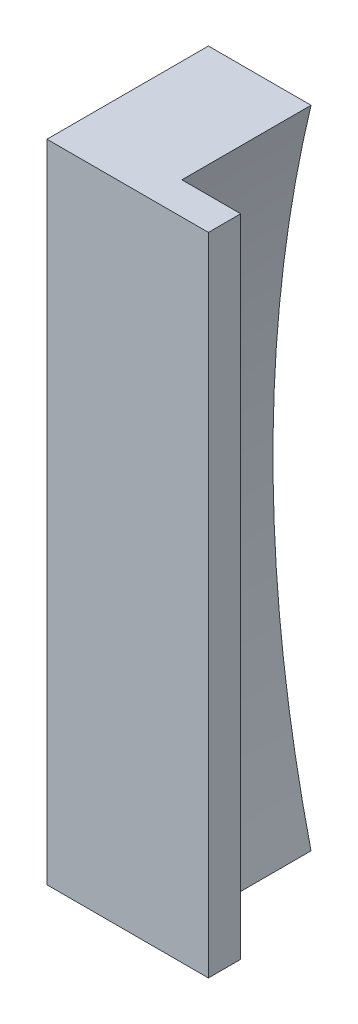
ISO-10303-21;
HEADER;
FILE_DESCRIPTION(('STEP AP214'),'2;1');
FILE_NAME('part.step','',(''),(''),'','','');
FILE_SCHEMA(('AUTOMOTIVE_DESIGN { 1 0 10303 214 1 1 1 1 }'));
ENDSEC;
DATA;
#1=APPLICATION_CONTEXT('core data for automotive mechanical design processes');
#2=APPLICATION_PROTOCOL_DEFINITION('international standard','automotive_design',2000,#1);
#3=PRODUCT_CONTEXT('',#1,'mechanical');
#4=PRODUCT('Part','Part','',(#3));
#5=PRODUCT_RELATED_PRODUCT_CATEGORY('part','',(#4));
#6=PRODUCT_DEFINITION_FORMATION('','',#4);
#7=PRODUCT_DEFINITION_CONTEXT('part definition',#1,'design');
#8=PRODUCT_DEFINITION('design','',#6,#7);
#9=PRODUCT_DEFINITION_SHAPE('','',#8);
#10=(LENGTH_UNIT() NAMED_UNIT(*) SI_UNIT(.MILLI.,.METRE.));
#11=(NAMED_UNIT(*) PLANE_ANGLE_UNIT() SI_UNIT($,.RADIAN.));
#12=(NAMED_UNIT(*) SI_UNIT($,.STERADIAN.) SOLID_ANGLE_UNIT());
#13=UNCERTAINTY_MEASURE_WITH_UNIT(LENGTH_MEASURE(1.E-05),#10,'distance_accuracy_value','');
#14=(GEOMETRIC_REPRESENTATION_CONTEXT(3) GLOBAL_UNCERTAINTY_ASSIGNED_CONTEXT((#13)) GLOBAL_UNIT_ASSIGNED_CONTEXT((#10,
#11,#12)) REPRESENTATION_CONTEXT('',''));
#15=CARTESIAN_POINT('',(0.,0.,0.));
#16=DIRECTION('',(0.,0.,1.));
#17=DIRECTION('',(1.,0.,0.));
#18=AXIS2_PLACEMENT_3D('',#15,#16,#17);
#19=CARTESIAN_POINT('',(-225.,-50.,20.));
#20=DIRECTION('',(0.,1.,0.));
#21=DIRECTION('',(0.,0.,1.));
#22=AXIS2_PLACEMENT_3D('',#19,#20,#21);
#23=PLANE('',#22);
#24=DIRECTION('',(1.,0.,0.));
#25=VECTOR('',#24,1.);
#26=CARTESIAN_POINT('',(-225.,-50.,0.));
#27=LINE('',#26,#25);
#28=CARTESIAN_POINT('',(-225.,-50.,0.));
#29=VERTEX_POINT('',#28);
#30=CARTESIAN_POINT('',(-209.105236663265,-49.9999999999999,0.));
#31=VERTEX_POINT('',#30);
#32=EDGE_CURVE('E113',#29,#31,#27,.T.);
#33=ORIENTED_EDGE('',*,*,#32,.T.);
#34=DIRECTION('',(0.,0.,-1.));
#35=VECTOR('',#34,1.);
#36=CARTESIAN_POINT('',(-209.105236663265,-49.9999999999999,20.));
#37=LINE('',#36,#35);
#38=CARTESIAN_POINT('',(-209.105236663265,-49.9999999999999,20.));
#39=VERTEX_POINT('',#38);
#40=EDGE_CURVE('E13',#39,#31,#37,.T.);
#41=ORIENTED_EDGE('',*,*,#40,.F.);
#42=DIRECTION('',(1.,0.,0.));
#43=VECTOR('',#42,1.);
#44=CARTESIAN_POINT('',(-225.,-50.,20.));
#45=LINE('',#44,#43);
#46=CARTESIAN_POINT('',(-200.,-50.,20.));
#47=VERTEX_POINT('',#46);
#48=EDGE_CURVE('E126',#39,#47,#45,.T.);
#49=ORIENTED_EDGE('',*,*,#48,.T.);
#50=DIRECTION('',(0.,0.,-1.));
#51=VECTOR('',#50,1.);
#52=CARTESIAN_POINT('',(-200.,-50.,25.));
#53=LINE('',#52,#51);
#54=CARTESIAN_POINT('',(-200.,-50.,25.));
#55=VERTEX_POINT('',#54);
#56=EDGE_CURVE('E129',#55,#47,#53,.T.);
#57=ORIENTED_EDGE('',*,*,#56,.F.);
#58=DIRECTION('',(1.,0.,0.));
#59=VECTOR('',#58,1.);
#60=CARTESIAN_POINT('',(-225.,-50.,25.));
#61=LINE('',#60,#59);
#62=CARTESIAN_POINT('',(-225.,-50.,25.));
#63=VERTEX_POINT('',#62);
#64=EDGE_CURVE('E138',#63,#55,#61,.T.);
#65=ORIENTED_EDGE('',*,*,#64,.F.);
#66=DIRECTION('',(0.,0.,-1.));
#67=VECTOR('',#66,1.);
#68=CARTESIAN_POINT('',(-225.,-50.,20.));
#69=LINE('',#68,#67);
#70=EDGE_CURVE('E108',#63,#29,#69,.T.);
#71=ORIENTED_EDGE('',*,*,#70,.T.);
#72=EDGE_LOOP('',(#33,#41,#49,#57,#65,#71));
#73=FACE_BOUND('',#72,.T.);
#74=ADVANCED_FACE('F51',(#73),#23,.F.);
#75=CARTESIAN_POINT('',(0.,0.,20.));
#76=DIRECTION('',(0.,0.,-1.));
#77=DIRECTION('',(-1.,0.,0.));
#78=AXIS2_PLACEMENT_3D('',#75,#76,#77);
#79=CYLINDRICAL_SURFACE('',#78,215.);
#80=CARTESIAN_POINT('',(-214.067746286076,19.9999999999999,14.6));
#81=CARTESIAN_POINT('',(-214.056683686705,20.118405768322,14.5999948020439));
#82=CARTESIAN_POINT('',(-214.045514038665,20.2368883065541,14.5899528441461));
#83=CARTESIAN_POINT('',(-214.023291392187,20.4705780491656,14.5500340414459));
#84=CARTESIAN_POINT('',(-214.012238551856,20.5857811018568,14.5201331273663));
#85=CARTESIAN_POINT('',(-213.990600998757,20.8095004724153,14.4413299024022));
#86=CARTESIAN_POINT('',(-213.98001609501,20.9180195254646,14.3924354245984));
#87=CARTESIAN_POINT('',(-213.959653102438,21.1252858532946,14.2770200021731));
#88=CARTESIAN_POINT('',(-213.949874806753,21.2240356347757,14.2105035953632));
#89=CARTESIAN_POINT('',(-213.931463061234,21.4088238080695,14.0618122799865));
#90=CARTESIAN_POINT('',(-213.922827922834,21.4948809701974,13.9796609135762));
#91=CARTESIAN_POINT('',(-213.906985360523,21.651971359339,13.801943015109));
#92=CARTESIAN_POINT('',(-213.899777962424,21.7230043147404,13.7063762405762));
#93=CARTESIAN_POINT('',(-213.887078951397,21.8476859682228,13.50499690364));
#94=CARTESIAN_POINT('',(-213.881579807887,21.9014110056734,13.3992320832465));
#95=CARTESIAN_POINT('',(-213.872455363641,21.9903353083278,13.1801065845262));
#96=CARTESIAN_POINT('',(-213.86883000485,22.0255351474878,13.0667461416531));
#97=CARTESIAN_POINT('',(-213.863600959992,22.0762505403622,12.8362236694212));
#98=CARTESIAN_POINT('',(-213.86198778453,22.0918584910434,12.7190821773704));
#99=CARTESIAN_POINT('',(-213.860812089535,22.1032370277366,12.4838305830348));
#100=CARTESIAN_POINT('',(-213.861249528835,22.0990080119807,12.3657205002423));
#101=CARTESIAN_POINT('',(-213.864154935625,22.0708728542559,12.1321902218266));
#102=CARTESIAN_POINT('',(-213.866617904808,22.0470151490457,12.0167641232541));
#103=CARTESIAN_POINT('',(-213.873476383068,21.9803824417683,11.7915695452984));
#104=CARTESIAN_POINT('',(-213.877871897723,21.9376073851129,11.681801082242));
#105=CARTESIAN_POINT('',(-213.888440963931,21.8343194712308,11.4708852436778));
#106=CARTESIAN_POINT('',(-213.894616634524,21.77378547281,11.3697483299458));
#107=CARTESIAN_POINT('',(-213.908522636441,21.6367435486169,11.1790699562606));
#108=CARTESIAN_POINT('',(-213.916252998311,21.5602353089766,11.0895287241998));
#109=CARTESIAN_POINT('',(-213.933034563232,21.3930781029328,10.9241792393322));
#110=CARTESIAN_POINT('',(-213.942091125842,21.30237164975,10.8484296496067));
#111=CARTESIAN_POINT('',(-213.961194830232,21.1096298121008,10.7132206084264));
#112=CARTESIAN_POINT('',(-213.971241998785,21.0075941214097,10.6537615974502));
#113=CARTESIAN_POINT('',(-213.992051370588,20.7945532944115,10.5525245213919));
#114=CARTESIAN_POINT('',(-214.002816804211,20.6835070720609,10.5108335717543));
#115=CARTESIAN_POINT('',(-214.024681655759,20.4560184733491,10.4467065915391));
#116=CARTESIAN_POINT('',(-214.035781080388,20.3395759886363,10.4242709477653));
#117=CARTESIAN_POINT('',(-214.058017390926,20.1042085834011,10.3992406484872));
#118=CARTESIAN_POINT('',(-214.069154285596,19.9852770472843,10.3967081595646));
#119=CARTESIAN_POINT('',(-214.091112855004,19.7486586008473,10.4117277217959));
#120=CARTESIAN_POINT('',(-214.101934528194,19.6309716966404,10.4292798715526));
#121=CARTESIAN_POINT('',(-214.122971273874,19.4001703672652,10.4839959757845));
#122=CARTESIAN_POINT('',(-214.133186247713,19.2870566866676,10.5211631100601));
#123=CARTESIAN_POINT('',(-214.152745331421,19.068657508172,10.6140827980269));
#124=CARTESIAN_POINT('',(-214.162089450417,18.9633719282355,10.6698351569112));
#125=CARTESIAN_POINT('',(-214.179658003397,18.7639045199138,10.798206782567));
#126=CARTESIAN_POINT('',(-214.187885128321,18.6696960818563,10.8707843301195));
#127=CARTESIAN_POINT('',(-214.203057831342,18.4948029749027,11.0308395789405));
#128=CARTESIAN_POINT('',(-214.210003433269,18.4141180545337,11.1183170030813));
#129=CARTESIAN_POINT('',(-214.222438548923,18.2688842370292,11.3053432694616));
#130=CARTESIAN_POINT('',(-214.227933340887,18.2042768983191,11.4048463784883));
#131=CARTESIAN_POINT('',(-214.237386596862,18.0926873088909,11.6133549643953));
#132=CARTESIAN_POINT('',(-214.241345092197,18.0457046988304,11.7223602474842));
#133=CARTESIAN_POINT('',(-214.247636123042,17.9708606159543,11.9463816009479));
#134=CARTESIAN_POINT('',(-214.249974115222,17.9429349781395,12.0613760835937));
#135=CARTESIAN_POINT('',(-214.253000593477,17.9067604992134,12.2944404260043));
#136=CARTESIAN_POINT('',(-214.253689098561,17.8985114313526,12.4125102503135));
#137=CARTESIAN_POINT('',(-214.25340379171,17.9019263136255,12.6481273471842));
#138=CARTESIAN_POINT('',(-214.252433230174,17.9135513269983,12.7656751901855));
#139=CARTESIAN_POINT('',(-214.248854506303,17.9563024251416,12.9971432490832));
#140=CARTESIAN_POINT('',(-214.246246346215,17.9874284831739,13.1110634699534));
#141=CARTESIAN_POINT('',(-214.239442715834,18.0682821466425,13.3320516897898));
#142=CARTESIAN_POINT('',(-214.235247198377,18.1180103047959,13.4391194850419));
#143=CARTESIAN_POINT('',(-214.225352371979,18.2346321828752,13.6433749752795));
#144=CARTESIAN_POINT('',(-214.219653111532,18.3015253492462,13.7405629887371));
#145=CARTESIAN_POINT('',(-214.206856437941,18.4506979197819,13.9225078620384));
#146=CARTESIAN_POINT('',(-214.1997564385,18.533005770839,14.0072412130688));
#147=CARTESIAN_POINT('',(-214.18431660534,18.7105972015089,14.1617137291843));
#148=CARTESIAN_POINT('',(-214.175976445055,18.8058841982919,14.2314489330218));
#149=CARTESIAN_POINT('',(-214.158214922374,19.0070832296884,14.3542014655185));
#150=CARTESIAN_POINT('',(-214.148789516164,19.1130348050698,14.4071533151264));
#151=CARTESIAN_POINT('',(-214.129118401254,19.3321676263891,14.4944623211581));
#152=CARTESIAN_POINT('',(-214.118873668081,19.4453402431064,14.5288412237953));
#153=CARTESIAN_POINT('',(-214.101758599373,19.6326832775439,14.568947454385));
#154=CARTESIAN_POINT('',(-214.09505474806,19.7056581036002,14.5805785729698));
#155=CARTESIAN_POINT('',(-214.081496558762,19.8524120085444,14.5961064731189));
#156=CARTESIAN_POINT('',(-214.074642220495,19.9261910889406,14.6000032401756));
#157=CARTESIAN_POINT('',(-214.067746286076,19.9999999999999,14.6));
#158=B_SPLINE_CURVE_WITH_KNOTS('',3,(#80,#81,#82,#83,#84,#85,#86,#87,#88,#89,#90,#91,#92,#93,
#94,#95,#96,#97,#98,#99,#100,#101,#102,#103,#104,#105,#106,#107,#108,#109,#110,#111,#112,#113,
#114,#115,#116,#117,#118,#119,#120,#121,#122,#123,#124,#125,#126,#127,#128,#129,#130,#131,#132,
#133,#134,#135,#136,#137,#138,#139,#140,#141,#142,#143,#144,#145,#146,#147,#148,#149,#150,#151,
#152,#153,#154,#155,#156,#157),.UNSPECIFIED.,.T.,.F.,(4,2,2,2,2,2,2,2,2,2,2,2,2,2,2,2,2,2,2,2,2,
2,2,2,2,2,2,2,2,2,2,2,2,2,2,2,2,2,4),(0.,0.356494068993477,0.713421003201601,1.07020089421283,
1.42688900021646,1.7830442167116,2.13920587134096,2.49377439798953,2.84833193858696,
3.20121099619343,3.5540829696938,3.9060867807611,4.25809160758325,4.61051719207525,
4.96294970181406,5.31684794916714,5.67075576457844,6.02637933956689,6.3820100582159,
6.73875113319237,7.09549395954878,7.45229463553366,7.80909157171977,8.16501309309369,
8.52092799528955,8.87552961128027,9.23012399707067,9.58351849033485,9.9369089111175,
10.2896077721342,10.6423061495609,10.9950150074131,11.347712492178,11.7010673902625,
12.0545155006568,12.4093260573666,12.7637202772944,12.9859424717808,13.2081650830978),.UNSPECIFIED.);
#159=CARTESIAN_POINT('',(-214.067746286076,19.9999999999999,14.6));
#160=VERTEX_POINT('',#159);
#161=EDGE_CURVE('E54',#160,#160,#158,.T.);
#162=ORIENTED_EDGE('',*,*,#161,.T.);
#163=EDGE_LOOP('',(#162));
#164=FACE_BOUND('',#163,.T.);
#165=CARTESIAN_POINT('',(-214.067746286076,-20.0000000000001,14.6));
#166=CARTESIAN_POINT('',(-214.078795900817,-19.8817301882432,14.5999948287127));
#167=CARTESIAN_POINT('',(-214.089754686069,-19.7633660134423,14.5899760143676));
#168=CARTESIAN_POINT('',(-214.111181147996,-19.5298719662258,14.5501311704216));
#169=CARTESIAN_POINT('',(-214.121648223365,-19.4147461195444,14.5202815321056));
#170=CARTESIAN_POINT('',(-214.14180530518,-19.1911390769391,14.4415922570399));
#171=CARTESIAN_POINT('',(-214.151495590624,-19.0826554986662,14.39275947561));
#172=CARTESIAN_POINT('',(-214.169859527226,-18.8754365239951,14.277473733881));
#173=CARTESIAN_POINT('',(-214.178533437704,-18.7766986420797,14.2110252822542));
#174=CARTESIAN_POINT('',(-214.194647004915,-18.5919817928338,14.0625289656708));
#175=CARTESIAN_POINT('',(-214.202089270952,-18.5059758940168,13.9805148902506));
#176=CARTESIAN_POINT('',(-214.21559710789,-18.3489559037631,13.8031061334116));
#177=CARTESIAN_POINT('',(-214.221662650439,-18.2779421210901,13.7077111764799));
#178=CARTESIAN_POINT('',(-214.232268370517,-18.153212027931,13.5066373708163));
#179=CARTESIAN_POINT('',(-214.236814205529,-18.0994315938648,13.4009985966171));
#180=CARTESIAN_POINT('',(-214.244320142457,-18.0103663546156,13.1821400575692));
#181=CARTESIAN_POINT('',(-214.247280276693,-17.9750811724547,13.0689204472894));
#182=CARTESIAN_POINT('',(-214.251550468728,-17.9241117122173,12.8384830620942));
#183=CARTESIAN_POINT('',(-214.252865500128,-17.9083683549144,12.7212784440806));
#184=CARTESIAN_POINT('',(-214.253836836357,-17.8967437484406,12.4858822051492));
#185=CARTESIAN_POINT('',(-214.253493161433,-17.9008622568304,12.3676905962965));
#186=CARTESIAN_POINT('',(-214.251155280701,-17.9288218541853,12.133846354299));
#187=CARTESIAN_POINT('',(-214.249163344691,-17.9526358207727,12.0181904539625));
#188=CARTESIAN_POINT('',(-214.24357007756,-18.0192616041395,11.7925283998952));
#189=CARTESIAN_POINT('',(-214.239968745129,-18.0620734363788,11.6825222507622));
#190=CARTESIAN_POINT('',(-214.231224508482,-18.1654927502966,11.4711995659996));
#191=CARTESIAN_POINT('',(-214.226080612725,-18.2261116776438,11.369888673611));
#192=CARTESIAN_POINT('',(-214.214356677428,-18.3633908420134,11.1788857275132));
#193=CARTESIAN_POINT('',(-214.207776623607,-18.4400512385557,11.0891937893597));
#194=CARTESIAN_POINT('',(-214.193301960141,-18.6074300286016,10.9237285053768));
#195=CARTESIAN_POINT('',(-214.185404116339,-18.6981829694623,10.8479903921075));
#196=CARTESIAN_POINT('',(-214.168482323948,-18.8910172283054,10.7128172152537));
#197=CARTESIAN_POINT('',(-214.15945835444,-18.9930987567157,10.6533824545741));
#198=CARTESIAN_POINT('',(-214.140462898272,-19.2060825823008,10.5522727628087));
#199=CARTESIAN_POINT('',(-214.130488102057,-19.3170154527597,10.5106628557401));
#200=CARTESIAN_POINT('',(-214.109868884952,-19.5442332101485,10.4466591466568));
#201=CARTESIAN_POINT('',(-214.099224450201,-19.6605182078461,10.4242657425355));
#202=CARTESIAN_POINT('',(-214.077509950885,-19.8955700436321,10.3992593652539));
#203=CARTESIAN_POINT('',(-214.066438535328,-20.0143441041216,10.3967154259488));
#204=CARTESIAN_POINT('',(-214.044216174972,-20.2506198660373,10.4116507524333));
#205=CARTESIAN_POINT('',(-214.033065229036,-20.3681215492043,10.4291303051858));
#206=CARTESIAN_POINT('',(-214.010993983391,-20.5987354575835,10.4836716849768));
#207=CARTESIAN_POINT('',(-214.000074128857,-20.7118395098317,10.520768262069));
#208=CARTESIAN_POINT('',(-213.978826019155,-20.9302188939143,10.6135307408688));
#209=CARTESIAN_POINT('',(-213.968497763419,-21.0354942332924,10.6691966246827));
#210=CARTESIAN_POINT('',(-213.948780767776,-21.2350952401685,10.7974730114853));
#211=CARTESIAN_POINT('',(-213.939391015864,-21.3294327201228,10.8700649748949));
#212=CARTESIAN_POINT('',(-213.921857475038,-21.5045729274478,11.030191166402));
#213=CARTESIAN_POINT('',(-213.913713663388,-21.5853759017932,11.1177251217824));
#214=CARTESIAN_POINT('',(-213.898987952851,-21.7308143249997,11.3048958628025));
#215=CARTESIAN_POINT('',(-213.892400134157,-21.7955111026993,11.4044845236008));
#216=CARTESIAN_POINT('',(-213.880984312854,-21.9072526401793,11.6132085716819));
#217=CARTESIAN_POINT('',(-213.876156258132,-21.954297922697,11.7223436761351));
#218=CARTESIAN_POINT('',(-213.868457896042,-22.0291655838576,11.9464843481467));
#219=CARTESIAN_POINT('',(-213.865578044896,-22.0570816805916,12.0614582875088));
#220=CARTESIAN_POINT('',(-213.8618454339,-22.0932433942431,12.2944906483412));
#221=CARTESIAN_POINT('',(-213.86099263075,-22.1014894313355,12.4125490038704));
#222=CARTESIAN_POINT('',(-213.861345509201,-22.098074549562,12.6479698233375));
#223=CARTESIAN_POINT('',(-213.862544181949,-22.086481411117,12.7653332875067));
#224=CARTESIAN_POINT('',(-213.866941716245,-22.0438584163375,12.9964363034746));
#225=CARTESIAN_POINT('',(-213.870140572458,-22.0128286118411,13.1101758649375));
#226=CARTESIAN_POINT('',(-213.878420235235,-21.9322362640557,13.3308179327652));
#227=CARTESIAN_POINT('',(-213.883501118888,-21.8826729616314,13.4377201588614));
#228=CARTESIAN_POINT('',(-213.89535996321,-21.766450870668,13.641677652174));
#229=CARTESIAN_POINT('',(-213.902137882971,-21.6997924942274,13.7387331566794));
#230=CARTESIAN_POINT('',(-213.917175831463,-21.5510434846163,13.9206023983652));
#231=CARTESIAN_POINT('',(-213.925440705283,-21.4689023594679,14.0053744302969));
#232=CARTESIAN_POINT('',(-213.943154831161,-21.2916513514297,14.1599601822683));
#233=CARTESIAN_POINT('',(-213.952604405964,-21.1965379339021,14.2297698120355));
#234=CARTESIAN_POINT('',(-213.972424468131,-20.9955189408884,14.3528112577085));
#235=CARTESIAN_POINT('',(-213.982799646537,-20.8895579368049,14.405951651847));
#236=CARTESIAN_POINT('',(-214.004085700375,-20.6703502821146,14.4936235045811));
#237=CARTESIAN_POINT('',(-214.014995935786,-20.5571122880331,14.5281766316493));
#238=CARTESIAN_POINT('',(-214.032933298376,-20.3693104614001,14.5686063797261));
#239=CARTESIAN_POINT('',(-214.039902144317,-20.2959547608009,14.5803640329503));
#240=CARTESIAN_POINT('',(-214.053841347019,-20.1484117637729,14.5960624768592));
#241=CARTESIAN_POINT('',(-214.060811703783,-20.0742244649917,14.6000032454269));
#242=CARTESIAN_POINT('',(-214.067746286076,-20.0000000000001,14.6));
#243=B_SPLINE_CURVE_WITH_KNOTS('',3,(#165,#166,#167,#168,#169,#170,#171,#172,#173,#174,#175,
#176,#177,#178,#179,#180,#181,#182,#183,#184,#185,#186,#187,#188,#189,#190,#191,#192,#193,#194,
#195,#196,#197,#198,#199,#200,#201,#202,#203,#204,#205,#206,#207,#208,#209,#210,#211,#212,#213,
#214,#215,#216,#217,#218,#219,#220,#221,#222,#223,#224,#225,#226,#227,#228,#229,#230,#231,#232,
#233,#234,#235,#236,#237,#238,#239,#240,#241,#242),.UNSPECIFIED.,.T.,.F.,(4,2,2,2,2,2,2,2,2,2,2,
2,2,2,2,2,2,2,2,2,2,2,2,2,2,2,2,2,2,2,2,2,2,2,2,2,2,2,4),(0.,0.356083322055518,
0.712591324915856,1.06897070263874,1.42525895415758,1.78078245006333,2.13631326729009,
2.49050539998707,2.84469031311341,3.19780181874559,3.55090901421512,3.90353075809811,
4.25615278893308,4.60900196850351,4.96185465704918,5.31558641956617,5.66932475373181,
6.02434273733654,6.37936807170395,6.73562759001407,7.09189221405535,7.44879005809346,
7.80568755821699,8.16219596044061,8.51869785646784,8.87382076239439,9.22893315076492,
9.58229308199237,9.93564546497861,10.2877930304942,10.6399396568266,10.9921007087248,
11.3442532721262,11.6975747851843,12.0509927629131,12.4063164636392,12.761225036114,
12.9846972721718,13.2081701405177),.UNSPECIFIED.);
#244=CARTESIAN_POINT('',(-214.067746286076,-20.0000000000001,14.6));
#245=VERTEX_POINT('',#244);
#246=EDGE_CURVE('E197',#245,#245,#243,.T.);
#247=ORIENTED_EDGE('',*,*,#246,.T.);
#248=EDGE_LOOP('',(#247));
#249=FACE_BOUND('',#248,.T.);
#250=CARTESIAN_POINT('',(-212.132034355964,-35.,18.75));
#251=CARTESIAN_POINT('',(-212.157743198507,-34.8441793712154,18.7499933716047));
#252=CARTESIAN_POINT('',(-212.183297373692,-34.6882189341659,18.7367150361686));
#253=CARTESIAN_POINT('',(-212.233374020232,-34.380508019975,18.6838689365627));
#254=CARTESIAN_POINT('',(-212.257895237478,-34.2287627324341,18.6442701424659));
#255=CARTESIAN_POINT('',(-212.305225250416,-33.9339596426442,18.5397833808407));
#256=CARTESIAN_POINT('',(-212.328034274065,-33.7909006844136,18.4748987869237));
#257=CARTESIAN_POINT('',(-212.371337079663,-33.5176721108433,18.3215811309469));
#258=CARTESIAN_POINT('',(-212.391831493093,-33.3874989811483,18.2331545139174));
#259=CARTESIAN_POINT('',(-212.429856652566,-33.1446983474763,18.035843703183));
#260=CARTESIAN_POINT('',(-212.447406557849,-33.0319578229405,17.9271023385286));
#261=CARTESIAN_POINT('',(-212.479272223645,-32.8263572159575,17.6917988321495));
#262=CARTESIAN_POINT('',(-212.493588053931,-32.7334967046139,17.5652370749839));
#263=CARTESIAN_POINT('',(-212.518482086532,-32.5714819358498,17.2995103610135));
#264=CARTESIAN_POINT('',(-212.529102814437,-32.5020582488621,17.1605136499308));
#265=CARTESIAN_POINT('',(-212.54658703651,-32.3875241027983,16.8726197593757));
#266=CARTESIAN_POINT('',(-212.553450768691,-32.3424121035286,16.7237232077494));
#267=CARTESIAN_POINT('',(-212.563209410244,-32.2782133825113,16.4218474656339));
#268=CARTESIAN_POINT('',(-212.56614306324,-32.2588726123828,16.2689235160674));
#269=CARTESIAN_POINT('',(-212.568099852848,-32.2459760441981,15.9619697776144));
#270=CARTESIAN_POINT('',(-212.56712313046,-32.2524193164318,15.8079400288002));
#271=CARTESIAN_POINT('',(-212.561295355168,-32.2908049290213,15.5038748018486));
#272=CARTESIAN_POINT('',(-212.556461729418,-32.322632571544,15.3538244868133));
#273=CARTESIAN_POINT('',(-212.543053720328,-32.4106816061483,15.0612400415964));
#274=CARTESIAN_POINT('',(-212.534479329665,-32.4669030459852,14.9187059261299));
#275=CARTESIAN_POINT('',(-212.51376462174,-32.6022164635286,14.6448175781787));
#276=CARTESIAN_POINT('',(-212.501616126258,-32.6813608867798,14.5134898870922));
#277=CARTESIAN_POINT('',(-212.474045463912,-32.8601302163276,14.2659979771573));
#278=CARTESIAN_POINT('',(-212.458623183159,-32.9597558351266,14.1498342860658));
#279=CARTESIAN_POINT('',(-212.424728479017,-33.1775065868086,13.934905824599));
#280=CARTESIAN_POINT('',(-212.406231716431,-33.2957789176456,13.8362940590864));
#281=CARTESIAN_POINT('',(-212.366729942292,-33.5468051413594,13.6602933930752));
#282=CARTESIAN_POINT('',(-212.345724783422,-33.6795598847404,13.5829057399373));
#283=CARTESIAN_POINT('',(-212.301469044713,-33.957417989447,13.4505935245478));
#284=CARTESIAN_POINT('',(-212.278195210388,-34.1026469107973,13.3959404174788));
#285=CARTESIAN_POINT('',(-212.230212174801,-34.3999958067743,13.3118085331786));
#286=CARTESIAN_POINT('',(-212.205502883592,-34.5521162130902,13.2823313352929));
#287=CARTESIAN_POINT('',(-212.155036383962,-34.8606543341995,13.2491072247721));
#288=CARTESIAN_POINT('',(-212.129270826766,-35.0171005432724,13.2456372309196));
#289=CARTESIAN_POINT('',(-212.077662799502,-35.328314825461,13.2652200105769));
#290=CARTESIAN_POINT('',(-212.051820326316,-35.4830828293446,13.2882738741195));
#291=CARTESIAN_POINT('',(-212.000684465445,-35.7873400717416,13.3604621419051));
#292=CARTESIAN_POINT('',(-211.975394405173,-35.9367995893013,13.4097243159581));
#293=CARTESIAN_POINT('',(-211.926273346924,-36.2253516881851,13.5330924904769));
#294=CARTESIAN_POINT('',(-211.902442340208,-36.364444331593,13.6071983421477));
#295=CARTESIAN_POINT('',(-211.857098672941,-36.6276881238045,13.7779188040647));
#296=CARTESIAN_POINT('',(-211.835577268289,-36.7518958513474,13.8744437987641));
#297=CARTESIAN_POINT('',(-211.795473442638,-36.982308379589,14.0875221793148));
#298=CARTESIAN_POINT('',(-211.776890845874,-37.0885142569745,14.2040743665037));
#299=CARTESIAN_POINT('',(-211.743526141351,-37.2785241107381,14.4524275504157));
#300=CARTESIAN_POINT('',(-211.728701079833,-37.3625817570469,14.5840286499454));
#301=CARTESIAN_POINT('',(-211.703102692915,-37.5073558266605,14.8598594722536));
#302=CARTESIAN_POINT('',(-211.692329007697,-37.5680743228064,15.0040880721369));
#303=CARTESIAN_POINT('',(-211.675364168598,-37.6635438614028,15.2988036989541));
#304=CARTESIAN_POINT('',(-211.669108090953,-37.6986628734659,15.4491678346133));
#305=CARTESIAN_POINT('',(-211.66115782209,-37.7432748140074,15.7537661667482));
#306=CARTESIAN_POINT('',(-211.659463332097,-37.7527694208414,15.9080001090902));
#307=CARTESIAN_POINT('',(-211.660693871783,-37.745869672677,16.2143532010394));
#308=CARTESIAN_POINT('',(-211.663573901446,-37.7297275093696,16.3664782843939));
#309=CARTESIAN_POINT('',(-211.673761691015,-37.6725290451559,16.6658124300348));
#310=CARTESIAN_POINT('',(-211.681069407466,-37.6314729887701,16.8130215405546));
#311=CARTESIAN_POINT('',(-211.699847659805,-37.5256894328058,17.0984375254189));
#312=CARTESIAN_POINT('',(-211.71131955598,-37.4609541980502,17.2366414406741));
#313=CARTESIAN_POINT('',(-211.73801638221,-37.3097612829791,17.5001950175557));
#314=CARTESIAN_POINT('',(-211.753241326517,-37.2233035201802,17.62554463037));
#315=CARTESIAN_POINT('',(-211.787091015035,-37.0302275771936,17.8612125314347));
#316=CARTESIAN_POINT('',(-211.805748183234,-36.9234167453659,17.9713682633167));
#317=CARTESIAN_POINT('',(-211.845741891013,-36.6932590683021,18.1722601058035));
#318=CARTESIAN_POINT('',(-211.867079282819,-36.5699069626124,18.2629900146778));
#319=CARTESIAN_POINT('',(-211.912085022942,-36.3082098066352,18.423847869141));
#320=CARTESIAN_POINT('',(-211.93578357024,-36.1696673789892,18.4936458805326));
#321=CARTESIAN_POINT('',(-211.984482154049,-35.8831487243692,18.6088972228403));
#322=CARTESIAN_POINT('',(-212.009480726306,-35.7351830705676,18.6543773188855));
#323=CARTESIAN_POINT('',(-212.050859712508,-35.4886238322934,18.7080282791124));
#324=CARTESIAN_POINT('',(-212.067078715936,-35.3915796778759,18.7237476099516));
#325=CARTESIAN_POINT('',(-212.099563747362,-35.1963755369719,18.7447356043724));
#326=CARTESIAN_POINT('',(-212.115829775765,-35.0982155408833,18.7500041779541));
#327=CARTESIAN_POINT('',(-212.132034355964,-35.,18.75));
#328=B_SPLINE_CURVE_WITH_KNOTS('',3,(#250,#251,#252,#253,#254,#255,#256,#257,#258,#259,#260,
#261,#262,#263,#264,#265,#266,#267,#268,#269,#270,#271,#272,#273,#274,#275,#276,#277,#278,#279,
#280,#281,#282,#283,#284,#285,#286,#287,#288,#289,#290,#291,#292,#293,#294,#295,#296,#297,#298,
#299,#300,#301,#302,#303,#304,#305,#306,#307,#308,#309,#310,#311,#312,#313,#314,#315,#316,#317,
#318,#319,#320,#321,#322,#323,#324,#325,#326,#327),.UNSPECIFIED.,.T.,.F.,(4,2,2,2,2,2,2,2,2,2,2,
2,2,2,2,2,2,2,2,2,2,2,2,2,2,2,2,2,2,2,2,2,2,2,2,2,2,2,4),(0.,0.473421533439659,
0.947402189099539,1.42131962827115,1.89510745764135,2.36568165242444,2.83624569389949,
3.30119962157083,3.76612409002455,4.22643064408871,4.68672060076265,5.1449424665674,
5.60316522942994,6.0624447563142,6.52174026337457,6.98486197240363,7.44801089369379,
7.91654131614411,8.38510112848105,8.85864306525779,9.33220446356076,9.80809599643483,
10.2839846791238,10.7580028808826,11.2319927217009,11.7002913235348,12.1685483243249,
12.6299341705865,13.0912897961161,13.5481350546623,14.0049758295173,14.4619659720849,
14.9189578499326,15.3805120412854,15.8422133656887,16.3108499190925,16.7789696077691,
17.0773700950066,17.3757731520041),.UNSPECIFIED.);
#329=CARTESIAN_POINT('',(-212.132034355964,-35.,18.75));
#330=VERTEX_POINT('',#329);
#331=EDGE_CURVE('E187',#330,#330,#328,.T.);
#332=ORIENTED_EDGE('',*,*,#331,.T.);
#333=EDGE_LOOP('',(#332));
#334=FACE_BOUND('',#333,.T.);
#335=CARTESIAN_POINT('',(-212.132034355964,34.9999999999999,18.75));
#336=CARTESIAN_POINT('',(-212.106256083534,35.1562383845381,18.7499932939568));
#337=CARTESIAN_POINT('',(-212.080285050748,35.3125620230791,18.7366433738056));
#338=CARTESIAN_POINT('',(-212.028719648635,35.6208724988484,18.683568807864));
#339=CARTESIAN_POINT('',(-212.003125782368,35.7728537602495,18.6438117131309));
#340=CARTESIAN_POINT('',(-211.953112389655,36.0679989283668,18.538973386243));
#341=CARTESIAN_POINT('',(-211.928692567505,36.2111650578991,18.4738985687246));
#342=CARTESIAN_POINT('',(-211.881801791233,36.4845354434892,18.3201809891879));
#343=CARTESIAN_POINT('',(-211.859330300485,36.614743270108,18.2315447441895));
#344=CARTESIAN_POINT('',(-211.817187020335,36.857759552548,18.0336310838986));
#345=CARTESIAN_POINT('',(-211.797501126553,36.9706559245441,17.9244646908528));
#346=CARTESIAN_POINT('',(-211.761472324761,37.1764681525295,17.6882021758264));
#347=CARTESIAN_POINT('',(-211.745129321339,37.2693845787846,17.5611065657517));
#348=CARTESIAN_POINT('',(-211.716577318405,37.4312379773278,17.2944410386325));
#349=CARTESIAN_POINT('',(-211.704315016711,37.5004844805263,17.1550647226525));
#350=CARTESIAN_POINT('',(-211.684074255505,37.6145727950377,16.8663677072592));
#351=CARTESIAN_POINT('',(-211.676095412325,37.6594167920885,16.7170478998319));
#352=CARTESIAN_POINT('',(-211.664803183156,37.7228329508241,16.4149381026938));
#353=CARTESIAN_POINT('',(-211.661426388552,37.74176219187,16.2622253707955));
#354=CARTESIAN_POINT('',(-211.659258761537,37.7539166520837,15.9557517941541));
#355=CARTESIAN_POINT('',(-211.660467683133,37.7471432500245,15.8019910060737));
#356=CARTESIAN_POINT('',(-211.667401066424,37.7082444974377,15.4989055543799));
#357=CARTESIAN_POINT('',(-211.67309420089,37.6762950291433,15.3495575447372));
#358=CARTESIAN_POINT('',(-211.688747228791,37.5882465645393,15.0583991743175));
#359=CARTESIAN_POINT('',(-211.698707154806,37.5321473838393,14.9165888711024));
#360=CARTESIAN_POINT('',(-211.722579818891,37.3972442954488,14.6439238889259));
#361=CARTESIAN_POINT('',(-211.736507066983,37.31835702778,14.5131117520554));
#362=CARTESIAN_POINT('',(-211.767812215291,37.1402996165394,14.2665806650403));
#363=CARTESIAN_POINT('',(-211.78519031007,37.0411283293099,14.1508625665335));
#364=CARTESIAN_POINT('',(-211.823046250238,36.824032060121,13.9362691021132));
#365=CARTESIAN_POINT('',(-211.843559411346,36.7058925229103,13.8376170683448));
#366=CARTESIAN_POINT('',(-211.886856177522,36.4551278697222,13.6614996763236));
#367=CARTESIAN_POINT('',(-211.909639958389,36.3225016320699,13.5840359602677));
#368=CARTESIAN_POINT('',(-211.957112247278,36.0444547636211,13.4513369399542));
#369=CARTESIAN_POINT('',(-211.98182352932,35.8988768888474,13.3964391683811));
#370=CARTESIAN_POINT('',(-212.03210436087,35.6006962226993,13.3119372165477));
#371=CARTESIAN_POINT('',(-212.057673963375,35.4480929973362,13.282334601103));
#372=CARTESIAN_POINT('',(-212.109180981636,35.138585407129,13.2490448501823));
#373=CARTESIAN_POINT('',(-212.135119546189,34.981653546456,13.2456145431121));
#374=CARTESIAN_POINT('',(-212.186377903174,34.6693823563249,13.2654671610042));
#375=CARTESIAN_POINT('',(-212.211697683654,34.5140430576673,13.2887506016362));
#376=CARTESIAN_POINT('',(-212.261051476875,34.2092078852157,13.3614912848006));
#377=CARTESIAN_POINT('',(-212.285084000074,34.0597188326576,13.4109781575394));
#378=CARTESIAN_POINT('',(-212.331188712622,33.7711071064542,13.5348469450399));
#379=CARTESIAN_POINT('',(-212.353260959555,33.6319841283267,13.6092281282289));
#380=CARTESIAN_POINT('',(-212.394718921504,33.3691620368933,13.7802537949185));
#381=CARTESIAN_POINT('',(-212.414122713154,33.245359776127,13.8767353294871));
#382=CARTESIAN_POINT('',(-212.449936384563,33.0157244817328,14.0895927609866));
#383=CARTESIAN_POINT('',(-212.466346445087,32.9098903631952,14.2059674559238));
#384=CARTESIAN_POINT('',(-212.495592004053,32.7205208048109,14.4538683726194));
#385=CARTESIAN_POINT('',(-212.508466664821,32.6367415281956,14.5852037050574));
#386=CARTESIAN_POINT('',(-212.530578316481,32.4924396536203,14.8603640603762));
#387=CARTESIAN_POINT('',(-212.539815545576,32.4319155327624,15.0041882646486));
#388=CARTESIAN_POINT('',(-212.554350197551,32.3365200750103,15.2985383661565));
#389=CARTESIAN_POINT('',(-212.559689852161,32.3013738056182,15.4489731114969));
#390=CARTESIAN_POINT('',(-212.566469526179,32.2567288017625,15.7536858269523));
#391=CARTESIAN_POINT('',(-212.567909711162,32.2472289783216,15.9079636336058));
#392=CARTESIAN_POINT('',(-212.566860541177,32.2541440499714,16.2149281095492));
#393=CARTESIAN_POINT('',(-212.56439635283,32.2703929751125,16.3676186353314));
#394=CARTESIAN_POINT('',(-212.555642575142,32.3280009825923,16.6680705863215));
#395=CARTESIAN_POINT('',(-212.549353015488,32.3693598700805,16.8158320497689));
#396=CARTESIAN_POINT('',(-212.533092428382,32.4759528013188,17.1022916547418));
#397=CARTESIAN_POINT('',(-212.523120609892,32.5411919751097,17.2409878412842));
#398=CARTESIAN_POINT('',(-212.499728241543,32.6935990052525,17.5054249097667));
#399=CARTESIAN_POINT('',(-212.486307741725,32.7807665434202,17.6311659796503));
#400=CARTESIAN_POINT('',(-212.456233682196,32.975119035298,17.8670469630635));
#401=CARTESIAN_POINT('',(-212.439559445015,33.0824318369265,17.9770788615538));
#402=CARTESIAN_POINT('',(-212.403429736983,33.31361128983,18.1776166576761));
#403=CARTESIAN_POINT('',(-212.383973436998,33.4374828753771,18.2681167140108));
#404=CARTESIAN_POINT('',(-212.342521853636,33.6997214165796,18.4280949518045));
#405=CARTESIAN_POINT('',(-212.320499996955,33.838238397912,18.4973199862892));
#406=CARTESIAN_POINT('',(-212.274673221751,34.124537292588,18.6114682448012));
#407=CARTESIAN_POINT('',(-212.250870318824,34.2723087027801,18.6564184806581));
#408=CARTESIAN_POINT('',(-212.211105690694,34.5174725887504,18.7090784389637));
#409=CARTESIAN_POINT('',(-212.19548857916,34.6133524014682,18.7244081739997));
#410=CARTESIAN_POINT('',(-212.163950503148,34.8061438639886,18.7448710668317));
#411=CARTESIAN_POINT('',(-212.148029536775,34.9030555202223,18.7500041610381));
#412=CARTESIAN_POINT('',(-212.132034355964,34.9999999999999,18.75));
#413=B_SPLINE_CURVE_WITH_KNOTS('',3,(#335,#336,#337,#338,#339,#340,#341,#342,#343,#344,#345,
#346,#347,#348,#349,#350,#351,#352,#353,#354,#355,#356,#357,#358,#359,#360,#361,#362,#363,#364,
#365,#366,#367,#368,#369,#370,#371,#372,#373,#374,#375,#376,#377,#378,#379,#380,#381,#382,#383,
#384,#385,#386,#387,#388,#389,#390,#391,#392,#393,#394,#395,#396,#397,#398,#399,#400,#401,#402,
#403,#404,#405,#406,#407,#408,#409,#410,#411,#412),.UNSPECIFIED.,.T.,.F.,(4,2,2,2,2,2,2,2,2,2,2,
2,2,2,2,2,2,2,2,2,2,2,2,2,2,2,2,2,2,2,2,2,2,2,2,2,2,2,4),(0.,0.474695131619659,
0.949974646922641,1.42513382115524,1.90016170430046,2.37269099937925,2.84520680577434,
3.3112832643168,3.77731796941103,4.23686426694521,4.69638591327861,5.15272545948553,
5.60906849004575,6.06710245660934,6.52516225525817,6.98882499216765,7.45252365499919,
7.92292574868604,8.39335694040285,8.8683986004549,9.34344943064188,9.81903858758137,
10.2946137695405,10.7667893273262,11.2389363651821,11.7056204589178,12.1722739859529,
12.6337928795306,13.0952921761856,13.5538288440839,14.0123619538349,14.4709936250275,
14.9296186417851,15.3912591597911,15.8530375477543,16.3201149288544,16.7866714921142,
17.0812136159135,17.375757576566),.UNSPECIFIED.);
#414=CARTESIAN_POINT('',(-212.132034355964,34.9999999999999,18.75));
#415=VERTEX_POINT('',#414);
#416=EDGE_CURVE('E155',#415,#415,#413,.T.);
#417=ORIENTED_EDGE('',*,*,#416,.T.);
#418=EDGE_LOOP('',(#417));
#419=FACE_BOUND('',#418,.T.);
#420=CARTESIAN_POINT('',(0.,0.,0.));
#421=DIRECTION('',(0.,0.,-1.));
#422=DIRECTION('',(1.,0.,0.));
#423=AXIS2_PLACEMENT_3D('',#420,#421,#422);
#424=CIRCLE('',#423,215.);
#425=CARTESIAN_POINT('',(-209.105236663265,50.,0.));
#426=VERTEX_POINT('',#425);
#427=EDGE_CURVE('E99',#31,#426,#424,.T.);
#428=ORIENTED_EDGE('',*,*,#427,.T.);
#429=DIRECTION('',(0.,0.,-1.));
#430=VECTOR('',#429,1.);
#431=CARTESIAN_POINT('',(-209.105236663265,50.,20.));
#432=LINE('',#431,#430);
#433=CARTESIAN_POINT('',(-209.105236663265,50.,20.));
#434=VERTEX_POINT('',#433);
#435=EDGE_CURVE('E63',#434,#426,#432,.T.);
#436=ORIENTED_EDGE('',*,*,#435,.F.);
#437=CARTESIAN_POINT('',(0.,0.,20.));
#438=DIRECTION('',(0.,0.,-1.));
#439=DIRECTION('',(1.,0.,0.));
#440=AXIS2_PLACEMENT_3D('',#437,#438,#439);
#441=CIRCLE('',#440,215.);
#442=EDGE_CURVE('E70',#39,#434,#441,.T.);
#443=ORIENTED_EDGE('',*,*,#442,.F.);
#444=ORIENTED_EDGE('',*,*,#40,.T.);
#445=EDGE_LOOP('',(#428,#436,#443,#444));
#446=FACE_BOUND('',#445,.T.);
#447=ADVANCED_FACE('F130',(#164,#249,#334,#419,#446),#79,.F.);
#448=CARTESIAN_POINT('',(-225.,50.,20.));
#449=DIRECTION('',(0.,-1.,0.));
#450=DIRECTION('',(1.,0.,0.));
#451=AXIS2_PLACEMENT_3D('',#448,#449,#450);
#452=PLANE('',#451);
#453=DIRECTION('',(-1.,0.,0.));
#454=VECTOR('',#453,1.);
#455=CARTESIAN_POINT('',(-225.,50.,0.));
#456=LINE('',#455,#454);
#457=CARTESIAN_POINT('',(-225.,50.,0.));
#458=VERTEX_POINT('',#457);
#459=EDGE_CURVE('E88',#426,#458,#456,.T.);
#460=ORIENTED_EDGE('',*,*,#459,.T.);
#461=DIRECTION('',(0.,0.,-1.));
#462=VECTOR('',#461,1.);
#463=CARTESIAN_POINT('',(-225.,50.,20.));
#464=LINE('',#463,#462);
#465=CARTESIAN_POINT('',(-225.,50.,25.));
#466=VERTEX_POINT('',#465);
#467=EDGE_CURVE('E93',#466,#458,#464,.T.);
#468=ORIENTED_EDGE('',*,*,#467,.F.);
#469=DIRECTION('',(-1.,0.,0.));
#470=VECTOR('',#469,1.);
#471=CARTESIAN_POINT('',(-225.,50.,25.));
#472=LINE('',#471,#470);
#473=CARTESIAN_POINT('',(-200.,50.,25.));
#474=VERTEX_POINT('',#473);
#475=EDGE_CURVE('E172',#474,#466,#472,.T.);
#476=ORIENTED_EDGE('',*,*,#475,.F.);
#477=DIRECTION('',(0.,0.,-1.));
#478=VECTOR('',#477,1.);
#479=CARTESIAN_POINT('',(-200.,50.,25.));
#480=LINE('',#479,#478);
#481=CARTESIAN_POINT('',(-200.,50.,20.));
#482=VERTEX_POINT('',#481);
#483=EDGE_CURVE('E161',#474,#482,#480,.T.);
#484=ORIENTED_EDGE('',*,*,#483,.T.);
#485=DIRECTION('',(-1.,0.,0.));
#486=VECTOR('',#485,1.);
#487=CARTESIAN_POINT('',(-225.,50.,20.));
#488=LINE('',#487,#486);
#489=EDGE_CURVE('E165',#482,#434,#488,.T.);
#490=ORIENTED_EDGE('',*,*,#489,.T.);
#491=ORIENTED_EDGE('',*,*,#435,.T.);
#492=EDGE_LOOP('',(#460,#468,#476,#484,#490,#491));
#493=FACE_BOUND('',#492,.T.);
#494=ADVANCED_FACE('F90',(#493),#452,.F.);
#495=CARTESIAN_POINT('',(-225.,50.,20.));
#496=DIRECTION('',(1.,0.,0.));
#497=DIRECTION('',(0.,1.,0.));
#498=AXIS2_PLACEMENT_3D('',#495,#496,#497);
#499=PLANE('',#498);
#500=CARTESIAN_POINT('',(-225.,19.9999999999999,12.5));
#501=DIRECTION('',(-1.,0.,0.));
#502=DIRECTION('',(0.,0.,1.));
#503=AXIS2_PLACEMENT_3D('',#500,#501,#502);
#504=CIRCLE('',#503,2.09999999999999);
#505=CARTESIAN_POINT('',(-225.,19.9999999999999,14.6));
#506=VERTEX_POINT('',#505);
#507=EDGE_CURVE('E201',#506,#506,#504,.T.);
#508=ORIENTED_EDGE('',*,*,#507,.F.);
#509=EDGE_LOOP('',(#508));
#510=FACE_BOUND('',#509,.T.);
#511=CARTESIAN_POINT('',(-225.,-20.0000000000001,12.5));
#512=DIRECTION('',(-1.,0.,0.));
#513=DIRECTION('',(0.,0.,1.));
#514=AXIS2_PLACEMENT_3D('',#511,#512,#513);
#515=CIRCLE('',#514,2.09999999999999);
#516=CARTESIAN_POINT('',(-225.,-20.0000000000001,14.6));
#517=VERTEX_POINT('',#516);
#518=EDGE_CURVE('E198',#517,#517,#515,.T.);
#519=ORIENTED_EDGE('',*,*,#518,.F.);
#520=EDGE_LOOP('',(#519));
#521=FACE_BOUND('',#520,.T.);
#522=CARTESIAN_POINT('',(-225.,-35.,16.));
#523=DIRECTION('',(-1.,0.,0.));
#524=DIRECTION('',(0.,0.,1.));
#525=AXIS2_PLACEMENT_3D('',#522,#523,#524);
#526=CIRCLE('',#525,4.99999999999999);
#527=CARTESIAN_POINT('',(-225.,-35.,21.));
#528=VERTEX_POINT('',#527);
#529=EDGE_CURVE('E194',#528,#528,#526,.T.);
#530=ORIENTED_EDGE('',*,*,#529,.F.);
#531=EDGE_LOOP('',(#530));
#532=FACE_BOUND('',#531,.T.);
#533=CARTESIAN_POINT('',(-225.,34.9999999999999,16.));
#534=DIRECTION('',(-1.,0.,0.));
#535=DIRECTION('',(0.,0.,1.));
#536=AXIS2_PLACEMENT_3D('',#533,#534,#535);
#537=CIRCLE('',#536,5.);
#538=CARTESIAN_POINT('',(-225.,34.9999999999999,21.));
#539=VERTEX_POINT('',#538);
#540=EDGE_CURVE('E184',#539,#539,#537,.T.);
#541=ORIENTED_EDGE('',*,*,#540,.F.);
#542=EDGE_LOOP('',(#541));
#543=FACE_BOUND('',#542,.T.);
#544=DIRECTION('',(0.,-1.,0.));
#545=VECTOR('',#544,1.);
#546=CARTESIAN_POINT('',(-225.,50.,0.));
#547=LINE('',#546,#545);
#548=EDGE_CURVE('E98',#458,#29,#547,.T.);
#549=ORIENTED_EDGE('',*,*,#548,.T.);
#550=ORIENTED_EDGE('',*,*,#70,.F.);
#551=DIRECTION('',(0.,-1.,0.));
#552=VECTOR('',#551,1.);
#553=CARTESIAN_POINT('',(-225.,-50.,25.));
#554=LINE('',#553,#552);
#555=EDGE_CURVE('E107',#466,#63,#554,.T.);
#556=ORIENTED_EDGE('',*,*,#555,.F.);
#557=ORIENTED_EDGE('',*,*,#467,.T.);
#558=EDGE_LOOP('',(#549,#550,#556,#557));
#559=FACE_BOUND('',#558,.T.);
#560=ADVANCED_FACE('F103',(#510,#521,#532,#543,#559),#499,.F.);
#561=CARTESIAN_POINT('',(0.,0.,0.));
#562=DIRECTION('',(0.,0.,1.));
#563=DIRECTION('',(1.,0.,0.));
#564=AXIS2_PLACEMENT_3D('',#561,#562,#563);
#565=PLANE('',#564);
#566=ORIENTED_EDGE('',*,*,#32,.F.);
#567=ORIENTED_EDGE('',*,*,#548,.F.);
#568=ORIENTED_EDGE('',*,*,#459,.F.);
#569=ORIENTED_EDGE('',*,*,#427,.F.);
#570=EDGE_LOOP('',(#566,#567,#568,#569));
#571=FACE_BOUND('',#570,.T.);
#572=ADVANCED_FACE('F111',(#571),#565,.F.);
#573=CARTESIAN_POINT('',(-200.,-50.,25.));
#574=DIRECTION('',(-1.,0.,0.));
#575=DIRECTION('',(0.,0.,1.));
#576=AXIS2_PLACEMENT_3D('',#573,#574,#575);
#577=PLANE('',#576);
#578=DIRECTION('',(0.,1.,0.));
#579=VECTOR('',#578,1.);
#580=CARTESIAN_POINT('',(-200.,-50.,20.));
#581=LINE('',#580,#579);
#582=EDGE_CURVE('E154',#47,#482,#581,.T.);
#583=ORIENTED_EDGE('',*,*,#582,.T.);
#584=ORIENTED_EDGE('',*,*,#483,.F.);
#585=DIRECTION('',(0.,1.,0.));
#586=VECTOR('',#585,1.);
#587=CARTESIAN_POINT('',(-200.,-50.,25.));
#588=LINE('',#587,#586);
#589=EDGE_CURVE('E160',#55,#474,#588,.T.);
#590=ORIENTED_EDGE('',*,*,#589,.F.);
#591=ORIENTED_EDGE('',*,*,#56,.T.);
#592=EDGE_LOOP('',(#583,#584,#590,#591));
#593=FACE_BOUND('',#592,.T.);
#594=ADVANCED_FACE('F157',(#593),#577,.F.);
#595=CARTESIAN_POINT('',(-225.,50.,25.));
#596=DIRECTION('',(0.,0.,-1.));
#597=DIRECTION('',(-1.,0.,0.));
#598=AXIS2_PLACEMENT_3D('',#595,#596,#597);
#599=PLANE('',#598);
#600=ORIENTED_EDGE('',*,*,#555,.T.);
#601=ORIENTED_EDGE('',*,*,#64,.T.);
#602=ORIENTED_EDGE('',*,*,#589,.T.);
#603=ORIENTED_EDGE('',*,*,#475,.T.);
#604=EDGE_LOOP('',(#600,#601,#602,#603));
#605=FACE_BOUND('',#604,.T.);
#606=ADVANCED_FACE('F269',(#605),#599,.F.);
#607=CARTESIAN_POINT('',(-225.,50.,20.));
#608=DIRECTION('',(0.,0.,-1.));
#609=DIRECTION('',(-1.,0.,0.));
#610=AXIS2_PLACEMENT_3D('',#607,#608,#609);
#611=PLANE('',#610);
#612=ORIENTED_EDGE('',*,*,#48,.F.);
#613=ORIENTED_EDGE('',*,*,#442,.T.);
#614=ORIENTED_EDGE('',*,*,#489,.F.);
#615=ORIENTED_EDGE('',*,*,#582,.F.);
#616=EDGE_LOOP('',(#612,#613,#614,#615));
#617=FACE_BOUND('',#616,.T.);
#618=ADVANCED_FACE('F164',(#617),#611,.T.);
#619=CARTESIAN_POINT('',(-225.,34.9999999999999,16.));
#620=DIRECTION('',(-1.,0.,0.));
#621=DIRECTION('',(0.,0.,1.));
#622=AXIS2_PLACEMENT_3D('',#619,#620,#621);
#623=CYLINDRICAL_SURFACE('',#622,2.75);
#624=CARTESIAN_POINT('',(-220.,34.9999999999999,16.));
#625=DIRECTION('',(-1.,0.,0.));
#626=DIRECTION('',(0.,0.,1.));
#627=AXIS2_PLACEMENT_3D('',#624,#625,#626);
#628=CIRCLE('',#627,2.75000000000001);
#629=CARTESIAN_POINT('',(-220.,34.9999999999999,18.75));
#630=VERTEX_POINT('',#629);
#631=EDGE_CURVE('E178',#630,#630,#628,.T.);
#632=ORIENTED_EDGE('',*,*,#631,.T.);
#633=EDGE_LOOP('',(#632));
#634=FACE_BOUND('',#633,.T.);
#635=ORIENTED_EDGE('',*,*,#416,.F.);
#636=EDGE_LOOP('',(#635));
#637=FACE_BOUND('',#636,.T.);
#638=ADVANCED_FACE('F263',(#634,#637),#623,.F.);
#639=CARTESIAN_POINT('',(-220.,37.75,16.));
#640=DIRECTION('',(1.,0.,0.));
#641=DIRECTION('',(0.,0.,-1.));
#642=AXIS2_PLACEMENT_3D('',#639,#640,#641);
#643=PLANE('',#642);
#644=ORIENTED_EDGE('',*,*,#631,.F.);
#645=EDGE_LOOP('',(#644));
#646=FACE_BOUND('',#645,.T.);
#647=CARTESIAN_POINT('',(-220.,34.9999999999999,16.));
#648=DIRECTION('',(-1.,0.,0.));
#649=DIRECTION('',(0.,0.,1.));
#650=AXIS2_PLACEMENT_3D('',#647,#648,#649);
#651=CIRCLE('',#650,5.);
#652=CARTESIAN_POINT('',(-220.,34.9999999999999,21.));
#653=VERTEX_POINT('',#652);
#654=EDGE_CURVE('E181',#653,#653,#651,.T.);
#655=ORIENTED_EDGE('',*,*,#654,.T.);
#656=EDGE_LOOP('',(#655));
#657=FACE_BOUND('',#656,.T.);
#658=ADVANCED_FACE('F260',(#646,#657),#643,.F.);
#659=CARTESIAN_POINT('',(-225.,34.9999999999999,16.));
#660=DIRECTION('',(-1.,0.,0.));
#661=DIRECTION('',(0.,0.,1.));
#662=AXIS2_PLACEMENT_3D('',#659,#660,#661);
#663=CYLINDRICAL_SURFACE('',#662,5.);
#664=ORIENTED_EDGE('',*,*,#654,.F.);
#665=EDGE_LOOP('',(#664));
#666=FACE_BOUND('',#665,.T.);
#667=ORIENTED_EDGE('',*,*,#540,.T.);
#668=EDGE_LOOP('',(#667));
#669=FACE_BOUND('',#668,.T.);
#670=ADVANCED_FACE('F256',(#666,#669),#663,.F.);
#671=CARTESIAN_POINT('',(-225.,-35.,16.));
#672=DIRECTION('',(-1.,0.,0.));
#673=DIRECTION('',(0.,0.,1.));
#674=AXIS2_PLACEMENT_3D('',#671,#672,#673);
#675=CYLINDRICAL_SURFACE('',#674,2.75);
#676=CARTESIAN_POINT('',(-220.,-35.,16.));
#677=DIRECTION('',(-1.,0.,0.));
#678=DIRECTION('',(0.,0.,1.));
#679=AXIS2_PLACEMENT_3D('',#676,#677,#678);
#680=CIRCLE('',#679,2.75000000000001);
#681=CARTESIAN_POINT('',(-220.,-35.,18.75));
#682=VERTEX_POINT('',#681);
#683=EDGE_CURVE('E188',#682,#682,#680,.T.);
#684=ORIENTED_EDGE('',*,*,#683,.T.);
#685=EDGE_LOOP('',(#684));
#686=FACE_BOUND('',#685,.T.);
#687=ORIENTED_EDGE('',*,*,#331,.F.);
#688=EDGE_LOOP('',(#687));
#689=FACE_BOUND('',#688,.T.);
#690=ADVANCED_FACE('F251',(#686,#689),#675,.F.);
#691=CARTESIAN_POINT('',(-220.,-32.25,16.));
#692=DIRECTION('',(1.,0.,0.));
#693=DIRECTION('',(0.,0.,-1.));
#694=AXIS2_PLACEMENT_3D('',#691,#692,#693);
#695=PLANE('',#694);
#696=ORIENTED_EDGE('',*,*,#683,.F.);
#697=EDGE_LOOP('',(#696));
#698=FACE_BOUND('',#697,.T.);
#699=CARTESIAN_POINT('',(-220.,-35.,16.));
#700=DIRECTION('',(-1.,0.,0.));
#701=DIRECTION('',(0.,0.,1.));
#702=AXIS2_PLACEMENT_3D('',#699,#700,#701);
#703=CIRCLE('',#702,4.99999999999999);
#704=CARTESIAN_POINT('',(-220.,-35.,21.));
#705=VERTEX_POINT('',#704);
#706=EDGE_CURVE('E191',#705,#705,#703,.T.);
#707=ORIENTED_EDGE('',*,*,#706,.T.);
#708=EDGE_LOOP('',(#707));
#709=FACE_BOUND('',#708,.T.);
#710=ADVANCED_FACE('F248',(#698,#709),#695,.F.);
#711=CARTESIAN_POINT('',(-225.,-35.,16.));
#712=DIRECTION('',(-1.,0.,0.));
#713=DIRECTION('',(0.,0.,1.));
#714=AXIS2_PLACEMENT_3D('',#711,#712,#713);
#715=CYLINDRICAL_SURFACE('',#714,4.99999999999999);
#716=ORIENTED_EDGE('',*,*,#706,.F.);
#717=EDGE_LOOP('',(#716));
#718=FACE_BOUND('',#717,.T.);
#719=ORIENTED_EDGE('',*,*,#529,.T.);
#720=EDGE_LOOP('',(#719));
#721=FACE_BOUND('',#720,.T.);
#722=ADVANCED_FACE('F216',(#718,#721),#715,.F.);
#723=CARTESIAN_POINT('',(-225.,-20.0000000000001,12.5));
#724=DIRECTION('',(-1.,0.,0.));
#725=DIRECTION('',(0.,0.,1.));
#726=AXIS2_PLACEMENT_3D('',#723,#724,#725);
#727=CYLINDRICAL_SURFACE('',#726,2.09999999999999);
#728=ORIENTED_EDGE('',*,*,#518,.T.);
#729=EDGE_LOOP('',(#728));
#730=FACE_BOUND('',#729,.T.);
#731=ORIENTED_EDGE('',*,*,#246,.F.);
#732=EDGE_LOOP('',(#731));
#733=FACE_BOUND('',#732,.T.);
#734=ADVANCED_FACE('F212',(#730,#733),#727,.F.);
#735=CARTESIAN_POINT('',(-225.,19.9999999999999,12.5));
#736=DIRECTION('',(-1.,0.,0.));
#737=DIRECTION('',(0.,0.,1.));
#738=AXIS2_PLACEMENT_3D('',#735,#736,#737);
#739=CYLINDRICAL_SURFACE('',#738,2.09999999999999);
#740=ORIENTED_EDGE('',*,*,#507,.T.);
#741=EDGE_LOOP('',(#740));
#742=FACE_BOUND('',#741,.T.);
#743=ORIENTED_EDGE('',*,*,#161,.F.);
#744=EDGE_LOOP('',(#743));
#745=FACE_BOUND('',#744,.T.);
#746=ADVANCED_FACE('F210',(#742,#745),#739,.F.);
#747=CLOSED_SHELL('',(#74,#447,#494,#560,#572,#594,#606,#618,#638,#658,#670,#690,#710,#722,#734,#746));
#748=MANIFOLD_SOLID_BREP('B2',#747);
#749=ADVANCED_BREP_SHAPE_REPRESENTATION('',(#18,#748),#14);
#750=SHAPE_DEFINITION_REPRESENTATION(#9,#749);
ENDSEC;
END-ISO-10303-21;
